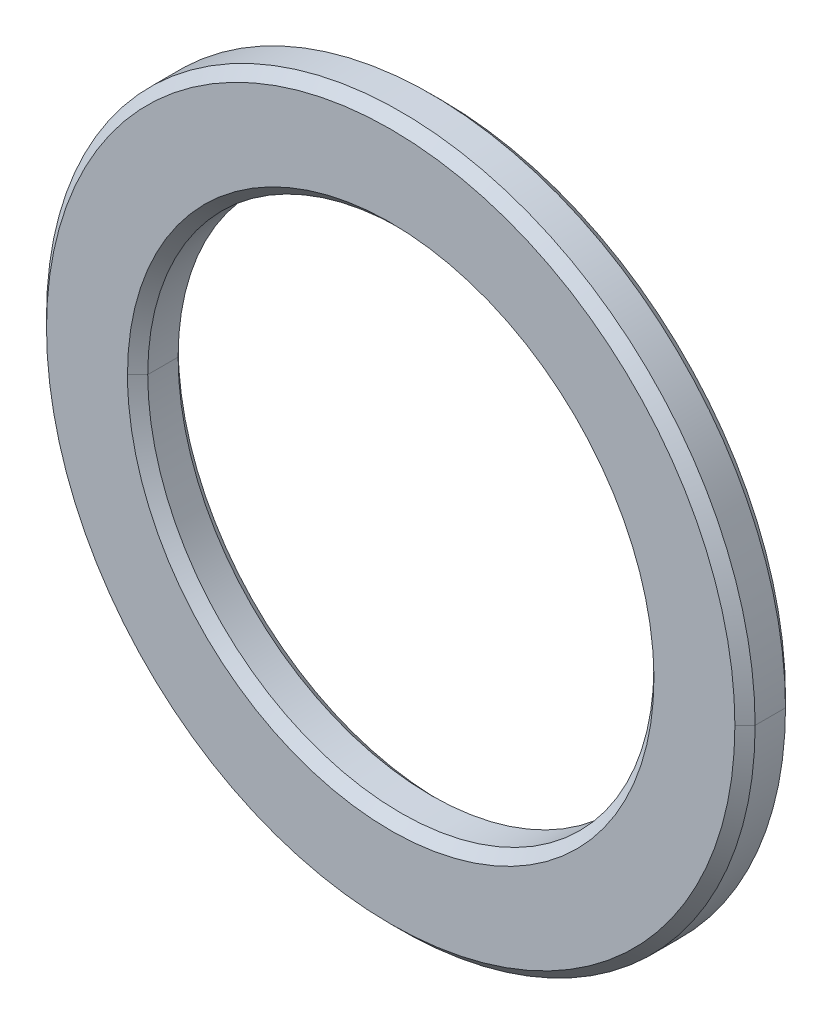
ISO-10303-21;
HEADER;
FILE_DESCRIPTION(('STEP AP214'),'2;1');
FILE_NAME('part.step','',(''),(''),'','','');
FILE_SCHEMA(('AUTOMOTIVE_DESIGN { 1 0 10303 214 1 1 1 1 }'));
ENDSEC;
DATA;
#1=APPLICATION_CONTEXT('core data for automotive mechanical design processes');
#2=APPLICATION_PROTOCOL_DEFINITION('international standard','automotive_design',2000,#1);
#3=PRODUCT_CONTEXT('',#1,'mechanical');
#4=PRODUCT('Part','Part','',(#3));
#5=PRODUCT_RELATED_PRODUCT_CATEGORY('part','',(#4));
#6=PRODUCT_DEFINITION_FORMATION('','',#4);
#7=PRODUCT_DEFINITION_CONTEXT('part definition',#1,'design');
#8=PRODUCT_DEFINITION('design','',#6,#7);
#9=PRODUCT_DEFINITION_SHAPE('','',#8);
#10=(LENGTH_UNIT() NAMED_UNIT(*) SI_UNIT(.MILLI.,.METRE.));
#11=(NAMED_UNIT(*) PLANE_ANGLE_UNIT() SI_UNIT($,.RADIAN.));
#12=(NAMED_UNIT(*) SI_UNIT($,.STERADIAN.) SOLID_ANGLE_UNIT());
#13=UNCERTAINTY_MEASURE_WITH_UNIT(LENGTH_MEASURE(1.E-05),#10,'distance_accuracy_value','');
#14=(GEOMETRIC_REPRESENTATION_CONTEXT(3) GLOBAL_UNCERTAINTY_ASSIGNED_CONTEXT((#13)) GLOBAL_UNIT_ASSIGNED_CONTEXT((#10,
#11,#12)) REPRESENTATION_CONTEXT('',''));
#15=CARTESIAN_POINT('',(0.,0.,0.));
#16=DIRECTION('',(0.,0.,1.));
#17=DIRECTION('',(1.,0.,0.));
#18=AXIS2_PLACEMENT_3D('',#15,#16,#17);
#19=CARTESIAN_POINT('',(0.,0.,0.));
#20=DIRECTION('',(0.,0.,-1.));
#21=DIRECTION('',(-1.,0.,0.));
#22=AXIS2_PLACEMENT_3D('',#19,#20,#21);
#23=CONICAL_SURFACE('',#22,2.6,0.785398163397);
#24=DIRECTION('',(0.707106781186548,0.,-0.707106781186548));
#25=VECTOR('',#24,1.);
#26=CARTESIAN_POINT('',(3535535.20593,4.32978187322E-10,-3535532.60593));
#27=LINE('',#26,#25);
#28=CARTESIAN_POINT('',(2.5,0.,0.1));
#29=VERTEX_POINT('',#28);
#30=CARTESIAN_POINT('',(2.6,0.,0.));
#31=VERTEX_POINT('',#30);
#32=EDGE_CURVE('E28',#29,#31,#27,.T.);
#33=ORIENTED_EDGE('',*,*,#32,.F.);
#34=CARTESIAN_POINT('',(0.,0.,0.0999999996275));
#35=DIRECTION('',(0.,0.,-1.));
#36=DIRECTION('',(1.,0.,0.));
#37=AXIS2_PLACEMENT_3D('',#34,#35,#36);
#38=CIRCLE('',#37,2.5);
#39=CARTESIAN_POINT('',(-2.5,0.,0.1));
#40=VERTEX_POINT('',#39);
#41=EDGE_CURVE('E98',#40,#29,#38,.T.);
#42=ORIENTED_EDGE('',*,*,#41,.F.);
#43=DIRECTION('',(-0.707106781186548,0.,-0.707106781186548));
#44=VECTOR('',#43,1.);
#45=CARTESIAN_POINT('',(-3535535.20593,-8.65956374644E-10,-3535532.60593));
#46=LINE('',#45,#44);
#47=CARTESIAN_POINT('',(-2.6,0.,0.));
#48=VERTEX_POINT('',#47);
#49=EDGE_CURVE('E11',#40,#48,#46,.T.);
#50=ORIENTED_EDGE('',*,*,#49,.T.);
#51=CARTESIAN_POINT('',(0.,0.,0.));
#52=DIRECTION('',(0.,0.,1.));
#53=DIRECTION('',(1.,0.,0.));
#54=AXIS2_PLACEMENT_3D('',#51,#52,#53);
#55=CIRCLE('',#54,2.59999999963);
#56=EDGE_CURVE('E163',#31,#48,#55,.T.);
#57=ORIENTED_EDGE('',*,*,#56,.F.);
#58=EDGE_LOOP('',(#33,#42,#50,#57));
#59=FACE_BOUND('',#58,.T.);
#60=ADVANCED_FACE('F17',(#59),#23,.F.);
#61=CARTESIAN_POINT('',(0.,0.,0.));
#62=DIRECTION('',(0.,0.,-1.));
#63=DIRECTION('',(-1.,0.,0.));
#64=AXIS2_PLACEMENT_3D('',#61,#62,#63);
#65=CONICAL_SURFACE('',#64,2.6,0.785398163397);
#66=CARTESIAN_POINT('',(0.,0.,0.1));
#67=DIRECTION('',(0.,0.,-1.));
#68=DIRECTION('',(1.,0.,0.));
#69=AXIS2_PLACEMENT_3D('',#66,#67,#68);
#70=CIRCLE('',#69,2.5);
#71=EDGE_CURVE('E92',#29,#40,#70,.T.);
#72=ORIENTED_EDGE('',*,*,#71,.F.);
#73=ORIENTED_EDGE('',*,*,#32,.T.);
#74=CARTESIAN_POINT('',(0.,0.,0.));
#75=DIRECTION('',(0.,0.,1.));
#76=DIRECTION('',(1.,0.,0.));
#77=AXIS2_PLACEMENT_3D('',#74,#75,#76);
#78=CIRCLE('',#77,2.59999999963);
#79=EDGE_CURVE('E96',#48,#31,#78,.T.);
#80=ORIENTED_EDGE('',*,*,#79,.F.);
#81=ORIENTED_EDGE('',*,*,#49,.F.);
#82=EDGE_LOOP('',(#72,#73,#80,#81));
#83=FACE_BOUND('',#82,.T.);
#84=ADVANCED_FACE('F90',(#83),#65,.F.);
#85=CARTESIAN_POINT('',(0.,0.,0.));
#86=DIRECTION('',(0.,0.,1.));
#87=DIRECTION('',(1.,0.,0.));
#88=AXIS2_PLACEMENT_3D('',#85,#86,#87);
#89=PLANE('',#88);
#90=ORIENTED_EDGE('',*,*,#79,.T.);
#91=ORIENTED_EDGE('',*,*,#56,.T.);
#92=EDGE_LOOP('',(#90,#91));
#93=FACE_BOUND('',#92,.T.);
#94=CARTESIAN_POINT('',(0.,0.,0.));
#95=DIRECTION('',(0.,0.,-1.));
#96=DIRECTION('',(1.,0.,0.));
#97=AXIS2_PLACEMENT_3D('',#94,#95,#96);
#98=CIRCLE('',#97,3.4);
#99=CARTESIAN_POINT('',(3.4,0.,0.));
#100=VERTEX_POINT('',#99);
#101=CARTESIAN_POINT('',(-3.4,0.,0.));
#102=VERTEX_POINT('',#101);
#103=EDGE_CURVE('E102',#100,#102,#98,.T.);
#104=ORIENTED_EDGE('',*,*,#103,.T.);
#105=CARTESIAN_POINT('',(0.,0.,0.));
#106=DIRECTION('',(0.,0.,-1.));
#107=DIRECTION('',(1.,0.,0.));
#108=AXIS2_PLACEMENT_3D('',#105,#106,#107);
#109=CIRCLE('',#108,3.4);
#110=EDGE_CURVE('E189',#102,#100,#109,.T.);
#111=ORIENTED_EDGE('',*,*,#110,.T.);
#112=EDGE_LOOP('',(#104,#111));
#113=FACE_BOUND('',#112,.T.);
#114=ADVANCED_FACE('F152',(#93,#113),#89,.F.);
#115=CARTESIAN_POINT('',(0.,0.,0.1));
#116=DIRECTION('',(0.,0.,1.));
#117=DIRECTION('',(1.,0.,0.));
#118=AXIS2_PLACEMENT_3D('',#115,#116,#117);
#119=CONICAL_SURFACE('',#118,3.5,0.785398163397);
#120=DIRECTION('',(-0.707106781186548,0.,0.707106781186548));
#121=VECTOR('',#120,1.);
#122=CARTESIAN_POINT('',(-3535535.65593,4.32978242431E-10,3535532.25593));
#123=LINE('',#122,#121);
#124=CARTESIAN_POINT('',(-3.5,0.,0.1));
#125=VERTEX_POINT('',#124);
#126=EDGE_CURVE('E179',#102,#125,#123,.T.);
#127=ORIENTED_EDGE('',*,*,#126,.F.);
#128=ORIENTED_EDGE('',*,*,#103,.F.);
#129=DIRECTION('',(0.707106781186548,0.,0.707106781186548));
#130=VECTOR('',#129,1.);
#131=CARTESIAN_POINT('',(3535535.65593,0.,3535532.25593));
#132=LINE('',#131,#130);
#133=CARTESIAN_POINT('',(3.5,0.,0.1));
#134=VERTEX_POINT('',#133);
#135=EDGE_CURVE('E170',#100,#134,#132,.T.);
#136=ORIENTED_EDGE('',*,*,#135,.T.);
#137=CARTESIAN_POINT('',(0.,0.,0.0999999996275));
#138=DIRECTION('',(0.,0.,1.));
#139=DIRECTION('',(1.,0.,0.));
#140=AXIS2_PLACEMENT_3D('',#137,#138,#139);
#141=CIRCLE('',#140,3.5);
#142=EDGE_CURVE('E195',#125,#134,#141,.T.);
#143=ORIENTED_EDGE('',*,*,#142,.F.);
#144=EDGE_LOOP('',(#127,#128,#136,#143));
#145=FACE_BOUND('',#144,.T.);
#146=ADVANCED_FACE('F149',(#145),#119,.T.);
#147=CARTESIAN_POINT('',(0.,0.,0.5));
#148=DIRECTION('',(0.,0.,-1.));
#149=DIRECTION('',(-1.,0.,0.));
#150=AXIS2_PLACEMENT_3D('',#147,#148,#149);
#151=CYLINDRICAL_SURFACE('',#150,2.5);
#152=DIRECTION('',(0.,0.,-1.));
#153=VECTOR('',#152,1.);
#154=CARTESIAN_POINT('',(2.5,0.,0.5));
#155=LINE('',#154,#153);
#156=CARTESIAN_POINT('',(2.5,0.,0.4));
#157=VERTEX_POINT('',#156);
#158=EDGE_CURVE('E116',#157,#29,#155,.T.);
#159=ORIENTED_EDGE('',*,*,#158,.F.);
#160=CARTESIAN_POINT('',(0.,0.,0.4));
#161=DIRECTION('',(0.,0.,1.));
#162=DIRECTION('',(1.,0.,0.));
#163=AXIS2_PLACEMENT_3D('',#160,#161,#162);
#164=CIRCLE('',#163,2.5);
#165=CARTESIAN_POINT('',(-2.5,0.,0.4));
#166=VERTEX_POINT('',#165);
#167=EDGE_CURVE('E109',#157,#166,#164,.T.);
#168=ORIENTED_EDGE('',*,*,#167,.T.);
#169=DIRECTION('',(0.,0.,-1.));
#170=VECTOR('',#169,1.);
#171=CARTESIAN_POINT('',(-2.5,0.,0.5));
#172=LINE('',#171,#170);
#173=EDGE_CURVE('E103',#166,#40,#172,.T.);
#174=ORIENTED_EDGE('',*,*,#173,.T.);
#175=ORIENTED_EDGE('',*,*,#41,.T.);
#176=EDGE_LOOP('',(#159,#168,#174,#175));
#177=FACE_BOUND('',#176,.T.);
#178=ADVANCED_FACE('F107',(#177),#151,.F.);
#179=CARTESIAN_POINT('',(0.,0.,0.5));
#180=DIRECTION('',(0.,0.,-1.));
#181=DIRECTION('',(-1.,0.,0.));
#182=AXIS2_PLACEMENT_3D('',#179,#180,#181);
#183=CYLINDRICAL_SURFACE('',#182,2.5);
#184=CARTESIAN_POINT('',(0.,0.,0.4));
#185=DIRECTION('',(0.,0.,1.));
#186=DIRECTION('',(1.,0.,0.));
#187=AXIS2_PLACEMENT_3D('',#184,#185,#186);
#188=CIRCLE('',#187,2.5);
#189=EDGE_CURVE('E224',#166,#157,#188,.T.);
#190=ORIENTED_EDGE('',*,*,#189,.T.);
#191=ORIENTED_EDGE('',*,*,#158,.T.);
#192=ORIENTED_EDGE('',*,*,#71,.T.);
#193=ORIENTED_EDGE('',*,*,#173,.F.);
#194=EDGE_LOOP('',(#190,#191,#192,#193));
#195=FACE_BOUND('',#194,.T.);
#196=ADVANCED_FACE('F115',(#195),#183,.F.);
#197=CARTESIAN_POINT('',(0.,0.,0.1));
#198=DIRECTION('',(0.,0.,1.));
#199=DIRECTION('',(1.,0.,0.));
#200=AXIS2_PLACEMENT_3D('',#197,#198,#199);
#201=CONICAL_SURFACE('',#200,3.5,0.785398163397);
#202=ORIENTED_EDGE('',*,*,#110,.F.);
#203=ORIENTED_EDGE('',*,*,#126,.T.);
#204=CARTESIAN_POINT('',(0.,0.,0.0999999996275));
#205=DIRECTION('',(0.,0.,1.));
#206=DIRECTION('',(1.,0.,0.));
#207=AXIS2_PLACEMENT_3D('',#204,#205,#206);
#208=CIRCLE('',#207,3.5);
#209=EDGE_CURVE('E202',#134,#125,#208,.T.);
#210=ORIENTED_EDGE('',*,*,#209,.F.);
#211=ORIENTED_EDGE('',*,*,#135,.F.);
#212=EDGE_LOOP('',(#202,#203,#210,#211));
#213=FACE_BOUND('',#212,.T.);
#214=ADVANCED_FACE('F135',(#213),#201,.T.);
#215=CARTESIAN_POINT('',(0.,0.,0.5));
#216=DIRECTION('',(0.,0.,-1.));
#217=DIRECTION('',(-1.,0.,0.));
#218=AXIS2_PLACEMENT_3D('',#215,#216,#217);
#219=CYLINDRICAL_SURFACE('',#218,3.5);
#220=DIRECTION('',(0.,0.,-1.));
#221=VECTOR('',#220,1.);
#222=CARTESIAN_POINT('',(3.5,0.,0.5));
#223=LINE('',#222,#221);
#224=CARTESIAN_POINT('',(3.5,0.,0.4));
#225=VERTEX_POINT('',#224);
#226=EDGE_CURVE('E198',#225,#134,#223,.T.);
#227=ORIENTED_EDGE('',*,*,#226,.F.);
#228=CARTESIAN_POINT('',(0.,0.,0.4));
#229=DIRECTION('',(0.,0.,-1.));
#230=DIRECTION('',(1.,0.,0.));
#231=AXIS2_PLACEMENT_3D('',#228,#229,#230);
#232=CIRCLE('',#231,3.5);
#233=CARTESIAN_POINT('',(-3.5,0.,0.4));
#234=VERTEX_POINT('',#233);
#235=EDGE_CURVE('E203',#225,#234,#232,.T.);
#236=ORIENTED_EDGE('',*,*,#235,.T.);
#237=DIRECTION('',(0.,0.,-1.));
#238=VECTOR('',#237,1.);
#239=CARTESIAN_POINT('',(-3.5,0.,0.5));
#240=LINE('',#239,#238);
#241=EDGE_CURVE('E230',#234,#125,#240,.T.);
#242=ORIENTED_EDGE('',*,*,#241,.T.);
#243=ORIENTED_EDGE('',*,*,#142,.T.);
#244=EDGE_LOOP('',(#227,#236,#242,#243));
#245=FACE_BOUND('',#244,.T.);
#246=ADVANCED_FACE('F146',(#245),#219,.T.);
#247=CARTESIAN_POINT('',(0.,0.,0.4));
#248=DIRECTION('',(0.,0.,1.));
#249=DIRECTION('',(1.,0.,0.));
#250=AXIS2_PLACEMENT_3D('',#247,#248,#249);
#251=CONICAL_SURFACE('',#250,2.5,0.785398163397);
#252=DIRECTION('',(-0.707106781186548,0.,0.707106781186548));
#253=VECTOR('',#252,1.);
#254=CARTESIAN_POINT('',(-3535535.15593,4.32978181199E-10,3535533.05593));
#255=LINE('',#254,#253);
#256=CARTESIAN_POINT('',(-2.6,0.,0.5));
#257=VERTEX_POINT('',#256);
#258=EDGE_CURVE('E120',#166,#257,#255,.T.);
#259=ORIENTED_EDGE('',*,*,#258,.F.);
#260=ORIENTED_EDGE('',*,*,#167,.F.);
#261=DIRECTION('',(0.707106781186548,0.,0.707106781186548));
#262=VECTOR('',#261,1.);
#263=CARTESIAN_POINT('',(3535535.15593,-8.65956362397E-10,3535533.05593));
#264=LINE('',#263,#262);
#265=CARTESIAN_POINT('',(2.6,0.,0.5));
#266=VERTEX_POINT('',#265);
#267=EDGE_CURVE('E196',#157,#266,#264,.T.);
#268=ORIENTED_EDGE('',*,*,#267,.T.);
#269=CARTESIAN_POINT('',(-2.59999999963,0.,0.5));
#270=CARTESIAN_POINT('',(-2.59999999963,0.236979114229,0.5));
#271=CARTESIAN_POINT('',(-2.57300043204,0.473957861313,0.5));
#272=CARTESIAN_POINT('',(-2.51899571507,0.706844084177,0.5));
#273=CARTESIAN_POINT('',(-2.35888464114,1.1561963391,0.5));
#274=CARTESIAN_POINT('',(-2.10179837777,1.55801503713,0.5));
#275=CARTESIAN_POINT('',(-1.950807479,1.74336403326,0.5));
#276=CARTESIAN_POINT('',(-1.60926845738,2.07638670702,0.5));
#277=CARTESIAN_POINT('',(-1.20157213839,2.32404640076,0.5));
#278=CARTESIAN_POINT('',(-0.984415685085,2.42402428449,0.5));
#279=CARTESIAN_POINT('',(-0.531164491435,2.57273998035,0.5));
#280=CARTESIAN_POINT('',(-0.0560780805943,2.61568777248,0.5));
#281=CARTESIAN_POINT('',(0.182917431736,2.60988681556,0.5));
#282=CARTESIAN_POINT('',(0.655362062543,2.54393932613,0.5));
#283=CARTESIAN_POINT('',(1.1008627736,2.3734086108,0.5));
#284=CARTESIAN_POINT('',(1.31291299736,2.26301291052,0.5));
#285=CARTESIAN_POINT('',(1.70811452072,1.99586359945,0.5));
#286=CARTESIAN_POINT('',(2.03309284653,1.64666352199,0.5));
#287=CARTESIAN_POINT('',(2.17491357311,1.45420731825,0.5));
#288=CARTESIAN_POINT('',(2.39956694945,1.06242311113,0.5));
#289=CARTESIAN_POINT('',(2.53533214099,0.632302686046,0.5));
#290=CARTESIAN_POINT('',(2.57844506884,0.423482316558,0.5));
#291=CARTESIAN_POINT('',(2.59999999963,0.211741011725,0.5));
#292=CARTESIAN_POINT('',(2.59999999963,0.,0.5));
#293=(BOUNDED_CURVE() B_SPLINE_CURVE(5,(#269,#270,#271,#272,#273,#274,#275,#276,#277,#278,#279,
#280,#281,#282,#283,#284,#285,#286,#287,#288,#289,#290,#291,#292),.UNSPECIFIED.,.F.,
.F.) B_SPLINE_CURVE_WITH_KNOTS((6,3,3,3,3,3,3,6),(0.,1.67569538671,3.35139077362,5.02708615686,
6.70278153072,8.37847689799,10.0541722568,11.5514073092),
.UNSPECIFIED.) CURVE() GEOMETRIC_REPRESENTATION_ITEM() RATIONAL_B_SPLINE_CURVE((1.,1.,1.,1.,1.,
1.,1.,1.,1.,1.,1.,1.,1.,1.,1.,1.,1.,1.,1.,1.,1.,1.,1.,1.)) REPRESENTATION_ITEM(''));
#294=EDGE_CURVE('E218',#257,#266,#293,.T.);
#295=ORIENTED_EDGE('',*,*,#294,.F.);
#296=EDGE_LOOP('',(#259,#260,#268,#295));
#297=FACE_BOUND('',#296,.T.);
#298=ADVANCED_FACE('F142',(#297),#251,.F.);
#299=CARTESIAN_POINT('',(0.,0.,0.4));
#300=DIRECTION('',(0.,0.,1.));
#301=DIRECTION('',(1.,0.,0.));
#302=AXIS2_PLACEMENT_3D('',#299,#300,#301);
#303=CONICAL_SURFACE('',#302,2.5,0.785398163397);
#304=ORIENTED_EDGE('',*,*,#189,.F.);
#305=ORIENTED_EDGE('',*,*,#258,.T.);
#306=CARTESIAN_POINT('',(2.59999999963,0.,0.5));
#307=CARTESIAN_POINT('',(2.59999999963,-0.236979114229,0.5));
#308=CARTESIAN_POINT('',(2.57300043204,-0.473957861313,0.5));
#309=CARTESIAN_POINT('',(2.51899571507,-0.706844084177,0.5));
#310=CARTESIAN_POINT('',(2.35888464114,-1.1561963391,0.5));
#311=CARTESIAN_POINT('',(2.10179837777,-1.55801503713,0.5));
#312=CARTESIAN_POINT('',(1.950807479,-1.74336403326,0.5));
#313=CARTESIAN_POINT('',(1.60926845737,-2.07638670702,0.5));
#314=CARTESIAN_POINT('',(1.20157213839,-2.32404640076,0.5));
#315=CARTESIAN_POINT('',(0.984415685086,-2.42402428449,0.5));
#316=CARTESIAN_POINT('',(0.531164491435,-2.57273998035,0.5));
#317=CARTESIAN_POINT('',(0.0560780805943,-2.61568777248,0.5));
#318=CARTESIAN_POINT('',(-0.182917431736,-2.60988681556,0.5));
#319=CARTESIAN_POINT('',(-0.655362062542,-2.54393932613,0.5));
#320=CARTESIAN_POINT('',(-1.1008627736,-2.3734086108,0.5));
#321=CARTESIAN_POINT('',(-1.31291299736,-2.26301291052,0.5));
#322=CARTESIAN_POINT('',(-1.70811452072,-1.99586359945,0.5));
#323=CARTESIAN_POINT('',(-2.03309284653,-1.64666352199,0.5));
#324=CARTESIAN_POINT('',(-2.17491357311,-1.45420731825,0.5));
#325=CARTESIAN_POINT('',(-2.39956694945,-1.06242311113,0.5));
#326=CARTESIAN_POINT('',(-2.53533214099,-0.632302686045,0.5));
#327=CARTESIAN_POINT('',(-2.57844506884,-0.423482316559,0.5));
#328=CARTESIAN_POINT('',(-2.59999999963,-0.211741011725,0.5));
#329=CARTESIAN_POINT('',(-2.59999999963,0.,0.5));
#330=(BOUNDED_CURVE() B_SPLINE_CURVE(5,(#306,#307,#308,#309,#310,#311,#312,#313,#314,#315,#316,
#317,#318,#319,#320,#321,#322,#323,#324,#325,#326,#327,#328,#329),.UNSPECIFIED.,.F.,
.F.) B_SPLINE_CURVE_WITH_KNOTS((6,3,3,3,3,3,3,6),(0.,1.67569538671,3.35139077362,5.02708615686,
6.70278153072,8.37847689799,10.0541722568,11.5514073092),
.UNSPECIFIED.) CURVE() GEOMETRIC_REPRESENTATION_ITEM() RATIONAL_B_SPLINE_CURVE((1.,1.,1.,1.,1.,
1.,1.,1.,1.,1.,1.,1.,1.,1.,1.,1.,1.,1.,1.,1.,1.,1.,1.,1.)) REPRESENTATION_ITEM(''));
#331=EDGE_CURVE('E215',#266,#257,#330,.T.);
#332=ORIENTED_EDGE('',*,*,#331,.F.);
#333=ORIENTED_EDGE('',*,*,#267,.F.);
#334=EDGE_LOOP('',(#304,#305,#332,#333));
#335=FACE_BOUND('',#334,.T.);
#336=ADVANCED_FACE('F138',(#335),#303,.F.);
#337=CARTESIAN_POINT('',(0.,0.,0.5));
#338=DIRECTION('',(0.,0.,-1.));
#339=DIRECTION('',(-1.,0.,0.));
#340=AXIS2_PLACEMENT_3D('',#337,#338,#339);
#341=CYLINDRICAL_SURFACE('',#340,3.5);
#342=CARTESIAN_POINT('',(0.,0.,0.4));
#343=DIRECTION('',(0.,0.,-1.));
#344=DIRECTION('',(1.,0.,0.));
#345=AXIS2_PLACEMENT_3D('',#342,#343,#344);
#346=CIRCLE('',#345,3.5);
#347=EDGE_CURVE('E208',#234,#225,#346,.T.);
#348=ORIENTED_EDGE('',*,*,#347,.T.);
#349=ORIENTED_EDGE('',*,*,#226,.T.);
#350=ORIENTED_EDGE('',*,*,#209,.T.);
#351=ORIENTED_EDGE('',*,*,#241,.F.);
#352=EDGE_LOOP('',(#348,#349,#350,#351));
#353=FACE_BOUND('',#352,.T.);
#354=ADVANCED_FACE('F141',(#353),#341,.T.);
#355=CARTESIAN_POINT('',(0.,0.,0.5));
#356=DIRECTION('',(0.,0.,-1.));
#357=DIRECTION('',(-1.,0.,0.));
#358=AXIS2_PLACEMENT_3D('',#355,#356,#357);
#359=CONICAL_SURFACE('',#358,3.4,0.785398163397);
#360=DIRECTION('',(0.707106781186548,0.,-0.707106781186548));
#361=VECTOR('',#360,1.);
#362=CARTESIAN_POINT('',(3535535.60593,4.32978236308E-10,-3535531.70593));
#363=LINE('',#362,#361);
#364=CARTESIAN_POINT('',(3.4,0.,0.5));
#365=VERTEX_POINT('',#364);
#366=EDGE_CURVE('E211',#365,#225,#363,.T.);
#367=ORIENTED_EDGE('',*,*,#366,.F.);
#368=CARTESIAN_POINT('',(0.,0.,0.5));
#369=DIRECTION('',(0.,0.,1.));
#370=DIRECTION('',(1.,0.,0.));
#371=AXIS2_PLACEMENT_3D('',#368,#369,#370);
#372=CIRCLE('',#371,3.40000000037);
#373=CARTESIAN_POINT('',(-3.4,0.,0.5));
#374=VERTEX_POINT('',#373);
#375=EDGE_CURVE('E212',#374,#365,#372,.T.);
#376=ORIENTED_EDGE('',*,*,#375,.F.);
#377=DIRECTION('',(-0.707106781186548,0.,-0.707106781186548));
#378=VECTOR('',#377,1.);
#379=CARTESIAN_POINT('',(-3535535.60593,0.,-3535531.70593));
#380=LINE('',#379,#378);
#381=EDGE_CURVE('E193',#374,#234,#380,.T.);
#382=ORIENTED_EDGE('',*,*,#381,.T.);
#383=ORIENTED_EDGE('',*,*,#235,.F.);
#384=EDGE_LOOP('',(#367,#376,#382,#383));
#385=FACE_BOUND('',#384,.T.);
#386=ADVANCED_FACE('F314',(#385),#359,.T.);
#387=CARTESIAN_POINT('',(0.,0.,0.5));
#388=DIRECTION('',(0.,0.,1.));
#389=DIRECTION('',(1.,0.,0.));
#390=AXIS2_PLACEMENT_3D('',#387,#388,#389);
#391=PLANE('',#390);
#392=ORIENTED_EDGE('',*,*,#331,.T.);
#393=ORIENTED_EDGE('',*,*,#294,.T.);
#394=EDGE_LOOP('',(#392,#393));
#395=FACE_BOUND('',#394,.T.);
#396=ORIENTED_EDGE('',*,*,#375,.T.);
#397=CARTESIAN_POINT('',(0.,0.,0.5));
#398=DIRECTION('',(0.,0.,1.));
#399=DIRECTION('',(1.,0.,0.));
#400=AXIS2_PLACEMENT_3D('',#397,#398,#399);
#401=CIRCLE('',#400,3.4);
#402=EDGE_CURVE('E234',#365,#374,#401,.T.);
#403=ORIENTED_EDGE('',*,*,#402,.T.);
#404=EDGE_LOOP('',(#396,#403));
#405=FACE_BOUND('',#404,.T.);
#406=ADVANCED_FACE('F19',(#395,#405),#391,.T.);
#407=CARTESIAN_POINT('',(0.,0.,0.5));
#408=DIRECTION('',(0.,0.,-1.));
#409=DIRECTION('',(-1.,0.,0.));
#410=AXIS2_PLACEMENT_3D('',#407,#408,#409);
#411=CONICAL_SURFACE('',#410,3.4,0.785398163397);
#412=ORIENTED_EDGE('',*,*,#402,.F.);
#413=ORIENTED_EDGE('',*,*,#366,.T.);
#414=ORIENTED_EDGE('',*,*,#347,.F.);
#415=ORIENTED_EDGE('',*,*,#381,.F.);
#416=EDGE_LOOP('',(#412,#413,#414,#415));
#417=FACE_BOUND('',#416,.T.);
#418=ADVANCED_FACE('F136',(#417),#411,.T.);
#419=CLOSED_SHELL('',(#60,#84,#114,#146,#178,#196,#214,#246,#298,#336,#354,#386,#406,#418));
#420=MANIFOLD_SOLID_BREP('B1',#419);
#421=ADVANCED_BREP_SHAPE_REPRESENTATION('',(#18,#420),#14);
#422=SHAPE_DEFINITION_REPRESENTATION(#9,#421);
ENDSEC;
END-ISO-10303-21;
